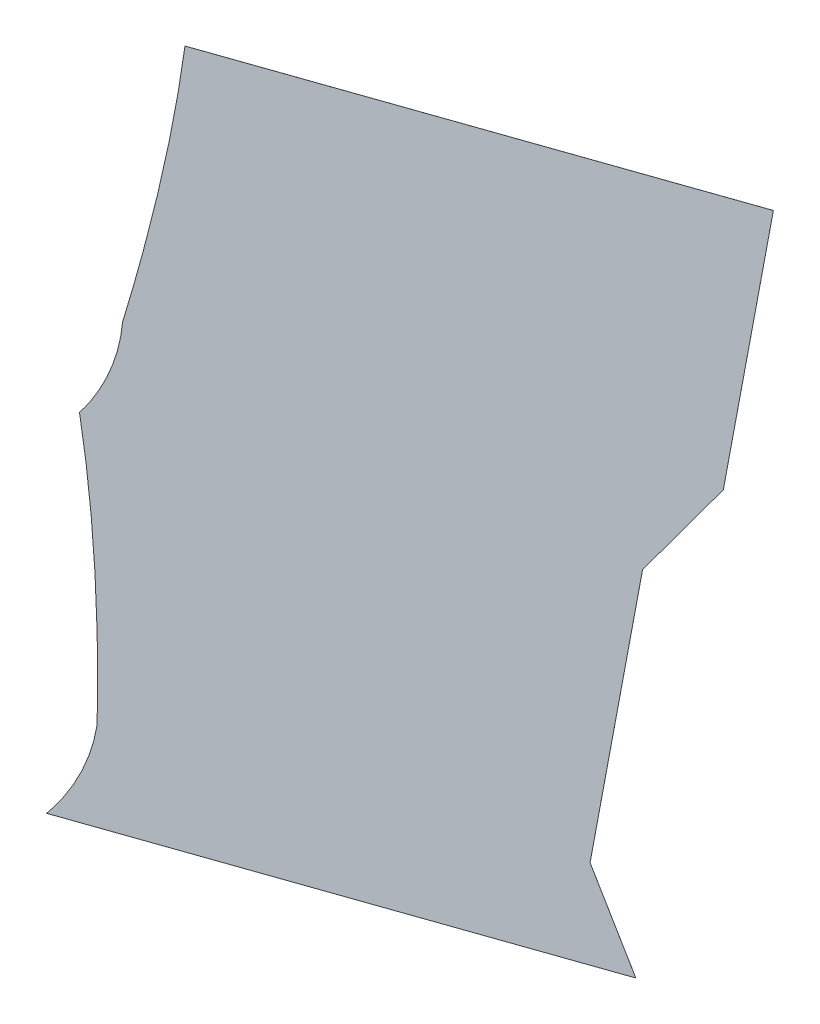
ISO-10303-21;
HEADER;
FILE_DESCRIPTION(('STEP AP214'),'2;1');
FILE_NAME('part.step','',(''),(''),'','','');
FILE_SCHEMA(('AUTOMOTIVE_DESIGN { 1 0 10303 214 1 1 1 1 }'));
ENDSEC;
DATA;
#1=APPLICATION_CONTEXT('core data for automotive mechanical design processes');
#2=APPLICATION_PROTOCOL_DEFINITION('international standard','automotive_design',2000,#1);
#3=PRODUCT_CONTEXT('',#1,'mechanical');
#4=PRODUCT('Part','Part','',(#3));
#5=PRODUCT_RELATED_PRODUCT_CATEGORY('part','',(#4));
#6=PRODUCT_DEFINITION_FORMATION('','',#4);
#7=PRODUCT_DEFINITION_CONTEXT('part definition',#1,'design');
#8=PRODUCT_DEFINITION('design','',#6,#7);
#9=PRODUCT_DEFINITION_SHAPE('','',#8);
#10=(LENGTH_UNIT() NAMED_UNIT(*) SI_UNIT(.MILLI.,.METRE.));
#11=(NAMED_UNIT(*) PLANE_ANGLE_UNIT() SI_UNIT($,.RADIAN.));
#12=(NAMED_UNIT(*) SI_UNIT($,.STERADIAN.) SOLID_ANGLE_UNIT());
#13=UNCERTAINTY_MEASURE_WITH_UNIT(LENGTH_MEASURE(1.E-05),#10,'distance_accuracy_value','');
#14=(GEOMETRIC_REPRESENTATION_CONTEXT(3) GLOBAL_UNCERTAINTY_ASSIGNED_CONTEXT((#13)) GLOBAL_UNIT_ASSIGNED_CONTEXT((#10,
#11,#12)) REPRESENTATION_CONTEXT('',''));
#15=CARTESIAN_POINT('',(0.,0.,0.));
#16=DIRECTION('',(0.,0.,1.));
#17=DIRECTION('',(1.,0.,0.));
#18=AXIS2_PLACEMENT_3D('',#15,#16,#17);
#19=CARTESIAN_POINT('',(151.680220925604,360.398931378131,313.47628043361));
#20=DIRECTION('',(0.887995978439146,-0.103444016227642,-0.448065260629072));
#21=DIRECTION('',(0.,-0.974370064785233,0.224951054343879));
#22=AXIS2_PLACEMENT_3D('',#19,#20,#21);
#23=PLANE('',#22);
#24=DIRECTION('',(0.459851217543135,0.199755631603012,0.865236699040776));
#25=VECTOR('',#24,1.);
#26=CARTESIAN_POINT('',(151.680220925604,360.418418779427,313.471781412523));
#27=LINE('',#26,#25);
#28=CARTESIAN_POINT('',(151.675622413428,360.416421223111,313.463129045533));
#29=VERTEX_POINT('',#28);
#30=CARTESIAN_POINT('',(151.680220925604,360.418418779427,313.471781412523));
#31=VERTEX_POINT('',#30);
#32=EDGE_CURVE('E505',#29,#31,#27,.T.);
#33=ORIENTED_EDGE('',*,*,#32,.F.);
#34=DIRECTION('',(0.,-0.974370064785233,0.224951054343879));
#35=VECTOR('',#34,1.);
#36=CARTESIAN_POINT('',(151.675622413428,360.396933821816,313.46762806662));
#37=LINE('',#36,#35);
#38=CARTESIAN_POINT('',(151.675622413428,434.624445357154,296.330856746703));
#39=VERTEX_POINT('',#38);
#40=EDGE_CURVE('E470',#39,#29,#37,.T.);
#41=ORIENTED_EDGE('',*,*,#40,.F.);
#42=DIRECTION('',(0.459851217543185,0.199755631602159,0.865236699040947));
#43=VECTOR('',#42,1.);
#44=CARTESIAN_POINT('',(151.680220925603,434.626442913471,296.339509113693));
#45=LINE('',#44,#43);
#46=CARTESIAN_POINT('',(151.680220925603,434.626442913471,296.339509113693));
#47=VERTEX_POINT('',#46);
#48=EDGE_CURVE('E514',#39,#47,#45,.T.);
#49=ORIENTED_EDGE('',*,*,#48,.T.);
#50=DIRECTION('',(0.,-0.974370064785233,0.224951054343879));
#51=VECTOR('',#50,1.);
#52=CARTESIAN_POINT('',(151.680220925604,360.398931378131,313.47628043361));
#53=LINE('',#52,#51);
#54=EDGE_CURVE('E476',#47,#31,#53,.T.);
#55=ORIENTED_EDGE('',*,*,#54,.T.);
#56=EDGE_LOOP('',(#33,#41,#49,#55));
#57=FACE_BOUND('',#56,.T.);
#58=ADVANCED_FACE('F231',(#57),#23,.T.);
#59=CARTESIAN_POINT('',(11.6802209255907,368.250898646985,386.069936995522));
#60=DIRECTION('',(-0.459851217543135,-0.199755631603012,-0.865236699040776));
#61=DIRECTION('',(0.123628089728887,-0.979282566119915,0.16038002096141));
#62=AXIS2_PLACEMENT_3D('',#59,#60,#61);
#63=ELLIPSE('',#62,146.750178018493,38.1);
#64=DIRECTION('',(-0.459851217543135,-0.199755631603012,-0.865236699040776));
#65=VECTOR('',#64,1.);
#66=SURFACE_OF_LINEAR_EXTRUSION('',#63,#65);
#67=DIRECTION('',(0.459851217546222,0.199755631601512,0.865236699039481));
#68=VECTOR('',#67,1.);
#69=CARTESIAN_POINT('',(29.5350343621643,448.852790168623,357.960589028568));
#70=LINE('',#69,#68);
#71=CARTESIAN_POINT('',(29.5350343621644,448.852790168623,357.960589028568));
#72=VERTEX_POINT('',#71);
#73=CARTESIAN_POINT('',(29.5396328743397,448.854787724939,357.969241395559));
#74=VERTEX_POINT('',#73);
#75=EDGE_CURVE('E571',#72,#74,#70,.T.);
#76=ORIENTED_EDGE('',*,*,#75,.F.);
#77=CARTESIAN_POINT('',(11.6756224134152,368.248901090669,386.061284628532));
#78=DIRECTION('',(-0.459851217543135,-0.199755631603012,-0.865236699040776));
#79=DIRECTION('',(0.123628089728887,-0.979282566119915,0.16038002096141));
#80=AXIS2_PLACEMENT_3D('',#77,#78,#79);
#81=ELLIPSE('',#80,146.750178018493,38.1);
#82=CARTESIAN_POINT('',(44.7456096076508,372.872862748157,367.417904990697));
#83=VERTEX_POINT('',#82);
#84=EDGE_CURVE('E480',#83,#72,#81,.F.);
#85=ORIENTED_EDGE('',*,*,#84,.F.);
#86=CARTESIAN_POINT('',(44.7456096076507,372.872862748157,367.417904990697));
#87=DIRECTION('',(0.459851217542939,0.199755631601894,0.865236699041138));
#88=VECTOR('',#87,1.);
#89=LINE('',#86,#88);
#90=CARTESIAN_POINT('',(44.7502081198261,372.874860304473,367.426557357687));
#91=VERTEX_POINT('',#90);
#92=EDGE_CURVE('E489',#83,#91,#89,.T.);
#93=ORIENTED_EDGE('',*,*,#92,.T.);
#94=EDGE_CURVE('E479',#91,#74,#63,.F.);
#95=ORIENTED_EDGE('',*,*,#94,.T.);
#96=EDGE_LOOP('',(#76,#85,#93,#95));
#97=FACE_BOUND('',#96,.T.);
#98=ADVANCED_FACE('F496',(#97),#66,.F.);
#99=CARTESIAN_POINT('',(158.540110462806,532.810776324648,270.026013494281));
#100=DIRECTION('',(-0.459851217543135,-0.199755631603012,-0.865236699040776));
#101=DIRECTION('',(-0.88303358136935,0.,0.469309806177135));
#102=AXIS2_PLACEMENT_3D('',#99,#100,#101);
#103=PLANE('',#102);
#104=ORIENTED_EDGE('',*,*,#54,.F.);
#105=DIRECTION('',(0.4073937609096,0.818319076946036,-0.405443228921287));
#106=VECTOR('',#105,1.);
#107=CARTESIAN_POINT('',(151.680220925603,434.62644291347,296.339509113693));
#108=LINE('',#107,#106);
#109=CARTESIAN_POINT('',(151.691023901252,434.648142512015,296.328757860853));
#110=VERTEX_POINT('',#109);
#111=EDGE_CURVE('E561',#47,#110,#108,.T.);
#112=ORIENTED_EDGE('',*,*,#111,.T.);
#113=DIRECTION('',(-0.461479806504052,-0.778701236932887,0.425042082373233));
#114=VECTOR('',#113,1.);
#115=CARTESIAN_POINT('',(153.532901416258,437.756127474735,294.632312115188));
#116=LINE('',#115,#114);
#117=CARTESIAN_POINT('',(165.389197024359,457.762446116088,283.7121710744));
#118=VERTEX_POINT('',#117);
#119=EDGE_CURVE('E586',#118,#110,#116,.T.);
#120=ORIENTED_EDGE('',*,*,#119,.F.);
#121=DIRECTION('',(0.407393760910254,0.818319076943882,-0.405443228924978));
#122=VECTOR('',#121,1.);
#123=CARTESIAN_POINT('',(165.389197024359,457.762446116089,283.712171074399));
#124=LINE('',#123,#122);
#125=CARTESIAN_POINT('',(165.400000000008,457.784145714633,283.701419821559));
#126=VERTEX_POINT('',#125);
#127=EDGE_CURVE('E382',#118,#126,#124,.T.);
#128=ORIENTED_EDGE('',*,*,#127,.T.);
#129=DIRECTION('',(0.,-0.974370064785231,0.224951054343883));
#130=VECTOR('',#129,1.);
#131=CARTESIAN_POINT('',(165.400000000008,532.011657249972,266.564648501642));
#132=LINE('',#131,#130);
#133=CARTESIAN_POINT('',(165.400000000008,528.554592260114,267.362774842454));
#134=VERTEX_POINT('',#133);
#135=EDGE_CURVE('E370',#134,#126,#132,.T.);
#136=ORIENTED_EDGE('',*,*,#135,.F.);
#137=DIRECTION('',(-0.887995978439146,0.103444016227646,0.448065260629072));
#138=VECTOR('',#137,1.);
#139=CARTESIAN_POINT('',(178.529228317984,527.025148275955,260.738025124001));
#140=LINE('',#139,#138);
#141=CARTESIAN_POINT('',(37.7599065995372,543.423582901519,331.76744908065));
#142=VERTEX_POINT('',#141);
#143=EDGE_CURVE('E360',#134,#142,#140,.T.);
#144=ORIENTED_EDGE('',*,*,#143,.T.);
#145=CARTESIAN_POINT('',(-5.4678483962789E-12,468.575510617685,369.115914550579));
#146=DIRECTION('',(-0.459851217543135,-0.199755631603012,-0.865236699040776));
#147=DIRECTION('',(0.123628089728889,0.95047931378405,-0.285140613555117));
#148=AXIS2_PLACEMENT_3D('',#145,#146,#147);
#149=ELLIPSE('',#148,146.750178018493,38.1);
#150=CARTESIAN_POINT('',(35.0929894453342,472.963809633931,349.451767867731));
#151=VERTEX_POINT('',#150);
#152=EDGE_CURVE('E354',#151,#142,#149,.F.);
#153=ORIENTED_EDGE('',*,*,#152,.F.);
#154=DIRECTION('',(0.0162631616268391,0.972312119159769,-0.233119395394161));
#155=VECTOR('',#154,1.);
#156=CARTESIAN_POINT('',(35.1146516202198,474.258908068786,349.141257941793));
#157=LINE('',#156,#155);
#158=CARTESIAN_POINT('',(35.0926061893349,472.94089622623,349.457261535499));
#159=VERTEX_POINT('',#158);
#160=EDGE_CURVE('E387',#151,#159,#157,.F.);
#161=ORIENTED_EDGE('',*,*,#160,.T.);
#162=CARTESIAN_POINT('',(1.08355746927222,474.626220510447,367.143114969039));
#163=DIRECTION('',(-0.459851217543135,-0.199755631603012,-0.865236699040776));
#164=DIRECTION('',(0.408346031858665,-0.912805555850603,-0.00628772403605971));
#165=AXIS2_PLACEMENT_3D('',#162,#163,#164);
#166=ELLIPSE('',#165,39.8408559221603,38.1);
#167=CARTESIAN_POINT('',(29.5457266033037,448.877035910867,357.960866335735));
#168=VERTEX_POINT('',#167);
#169=EDGE_CURVE('E392',#168,#159,#166,.F.);
#170=ORIENTED_EDGE('',*,*,#169,.F.);
#171=DIRECTION('',(0.248308867035991,0.90657491893723,-0.341269135588407));
#172=VECTOR('',#171,1.);
#173=CARTESIAN_POINT('',(34.3183120304122,466.301730801343,351.401551226803));
#174=LINE('',#173,#172);
#175=EDGE_CURVE('E557',#168,#74,#174,.F.);
#176=ORIENTED_EDGE('',*,*,#175,.T.);
#177=ORIENTED_EDGE('',*,*,#94,.F.);
#178=DIRECTION('',(-0.126241724840063,0.979179490256308,-0.158967143683226));
#179=VECTOR('',#178,1.);
#180=CARTESIAN_POINT('',(45.8322516540133,364.482113472291,368.789097121688));
#181=LINE('',#180,#179);
#182=CARTESIAN_POINT('',(44.7532131423753,372.851552190998,367.430341366912));
#183=VERTEX_POINT('',#182);
#184=EDGE_CURVE('E471',#91,#183,#181,.F.);
#185=ORIENTED_EDGE('',*,*,#184,.T.);
#186=CARTESIAN_POINT('',(10.5966634563131,374.554059089428,385.190620879374));
#187=DIRECTION('',(-0.459851217543135,-0.199755631603012,-0.865236699040776));
#188=DIRECTION('',(0.408346031858667,0.817667842230929,-0.405798987242079));
#189=AXIS2_PLACEMENT_3D('',#186,#187,#188);
#190=ELLIPSE('',#189,39.8408559221603,38.1);
#191=CARTESIAN_POINT('',(37.5922025299442,348.95623707825,376.752903875654));
#192=VERTEX_POINT('',#191);
#193=EDGE_CURVE('E428',#192,#183,#190,.F.);
#194=ORIENTED_EDGE('',*,*,#193,.F.);
#195=DIRECTION('',(-0.887995978439146,0.103444016227646,0.448065260629071));
#196=VECTOR('',#195,1.);
#197=CARTESIAN_POINT('',(158.540110462806,334.866829406721,315.72497446348));
#198=LINE('',#197,#196);
#199=CARTESIAN_POINT('',(165.400000000008,334.067710332046,312.263609470842));
#200=VERTEX_POINT('',#199);
#201=EDGE_CURVE('E458',#200,#192,#198,.T.);
#202=ORIENTED_EDGE('',*,*,#201,.F.);
#203=DIRECTION('',(0.46147980650405,-0.88621822068465,-0.0406651388232901));
#204=VECTOR('',#203,1.);
#205=CARTESIAN_POINT('',(153.532901416258,356.857091022939,313.309326324616));
#206=LINE('',#205,#204);
#207=CARTESIAN_POINT('',(151.691023901253,360.394202270411,313.471630728379));
#208=VERTEX_POINT('',#207);
#209=EDGE_CURVE('E437',#208,#200,#206,.T.);
#210=ORIENTED_EDGE('',*,*,#209,.F.);
#211=DIRECTION('',(-0.407393760909242,0.913234927552378,0.00568248806658753));
#212=VECTOR('',#211,1.);
#213=CARTESIAN_POINT('',(151.691023901253,360.394202270411,313.471630728379));
#214=LINE('',#213,#212);
#215=EDGE_CURVE('E466',#208,#31,#214,.T.);
#216=ORIENTED_EDGE('',*,*,#215,.T.);
#217=EDGE_LOOP('',(#104,#112,#120,#128,#136,#144,#153,#161,#170,#176,#177,#185,#194,#202,#210,#216));
#218=FACE_BOUND('',#217,.T.);
#219=ADVANCED_FACE('F233',(#218),#103,.F.);
#220=CARTESIAN_POINT('',(158.535511950631,359.59781474714,310.006263073981));
#221=DIRECTION('',(-0.459851217543135,-0.199755631603012,-0.865236699040776));
#222=DIRECTION('',(0.88303358136935,-0.205731877933245,-0.421812859661817));
#223=AXIS2_PLACEMENT_3D('',#220,#221,#222);
#224=PLANE('',#223);
#225=ORIENTED_EDGE('',*,*,#40,.T.);
#226=DIRECTION('',(-0.407393760909242,0.913234927552378,0.00568248806658753));
#227=VECTOR('',#226,1.);
#228=CARTESIAN_POINT('',(151.686425389077,360.392204714095,313.462978361389));
#229=LINE('',#228,#227);
#230=CARTESIAN_POINT('',(151.686425389077,360.392204714095,313.462978361389));
#231=VERTEX_POINT('',#230);
#232=EDGE_CURVE('E472',#231,#29,#229,.T.);
#233=ORIENTED_EDGE('',*,*,#232,.F.);
#234=DIRECTION('',(0.46147980650405,-0.88621822068465,-0.0406651388232901));
#235=VECTOR('',#234,1.);
#236=CARTESIAN_POINT('',(153.528302904082,356.855093466623,313.300673957626));
#237=LINE('',#236,#235);
#238=CARTESIAN_POINT('',(165.395401487833,334.06571277573,312.254957103851));
#239=VERTEX_POINT('',#238);
#240=EDGE_CURVE('E433',#231,#239,#237,.T.);
#241=ORIENTED_EDGE('',*,*,#240,.T.);
#242=DIRECTION('',(-0.887995978439146,0.103444016227646,0.448065260629071));
#243=VECTOR('',#242,1.);
#244=CARTESIAN_POINT('',(158.53551195063,334.864831850405,315.71632209649));
#245=LINE('',#244,#243);
#246=CARTESIAN_POINT('',(37.5876040177688,348.954239521934,376.744251508664));
#247=VERTEX_POINT('',#246);
#248=EDGE_CURVE('E449',#239,#247,#245,.T.);
#249=ORIENTED_EDGE('',*,*,#248,.T.);
#250=CARTESIAN_POINT('',(10.5920649441376,374.552061533112,385.181968512383));
#251=DIRECTION('',(-0.459851217543135,-0.199755631603012,-0.865236699040776));
#252=DIRECTION('',(0.408346031858667,0.817667842230929,-0.405798987242079));
#253=AXIS2_PLACEMENT_3D('',#250,#251,#252);
#254=ELLIPSE('',#253,39.8408559221603,38.1);
#255=CARTESIAN_POINT('',(44.7486146301999,372.849554634682,367.421688999921));
#256=VERTEX_POINT('',#255);
#257=EDGE_CURVE('E446',#247,#256,#254,.F.);
#258=ORIENTED_EDGE('',*,*,#257,.T.);
#259=DIRECTION('',(-0.126241724840063,0.979179490256308,-0.158967143683226));
#260=VECTOR('',#259,1.);
#261=CARTESIAN_POINT('',(45.8276531418378,364.480115915975,368.780444754698));
#262=LINE('',#261,#260);
#263=EDGE_CURVE('E441',#83,#256,#262,.F.);
#264=ORIENTED_EDGE('',*,*,#263,.F.);
#265=ORIENTED_EDGE('',*,*,#84,.T.);
#266=DIRECTION('',(0.248308867035991,0.90657491893723,-0.341269135588407));
#267=VECTOR('',#266,1.);
#268=CARTESIAN_POINT('',(34.3137135182367,466.299733245027,351.392898859812));
#269=LINE('',#268,#267);
#270=CARTESIAN_POINT('',(29.5411280911282,448.875038354551,357.952213968745));
#271=VERTEX_POINT('',#270);
#272=EDGE_CURVE('E396',#271,#72,#269,.F.);
#273=ORIENTED_EDGE('',*,*,#272,.F.);
#274=CARTESIAN_POINT('',(1.0789589570967,474.624222954131,367.134462602049));
#275=DIRECTION('',(-0.459851217543135,-0.199755631603012,-0.865236699040776));
#276=DIRECTION('',(0.408346031858665,-0.912805555850603,-0.00628772403605971));
#277=AXIS2_PLACEMENT_3D('',#274,#275,#276);
#278=ELLIPSE('',#277,39.8408559221603,38.1);
#279=CARTESIAN_POINT('',(35.0880076771595,472.938898669914,349.448609168509));
#280=VERTEX_POINT('',#279);
#281=EDGE_CURVE('E249',#271,#280,#278,.F.);
#282=ORIENTED_EDGE('',*,*,#281,.T.);
#283=DIRECTION('',(0.0162631616268391,0.972312119159769,-0.233119395394161));
#284=VECTOR('',#283,1.);
#285=CARTESIAN_POINT('',(35.1100531080445,474.25691051247,349.132605574802));
#286=LINE('',#285,#284);
#287=CARTESIAN_POINT('',(35.0883909331589,472.961812077615,349.443115500741));
#288=VERTEX_POINT('',#287);
#289=EDGE_CURVE('E367',#288,#280,#286,.F.);
#290=ORIENTED_EDGE('',*,*,#289,.F.);
#291=CARTESIAN_POINT('',(-0.00459851218084784,468.573513061369,369.107262183589));
#292=DIRECTION('',(-0.459851217543135,-0.199755631603012,-0.865236699040776));
#293=DIRECTION('',(0.123628089728889,0.95047931378405,-0.285140613555117));
#294=AXIS2_PLACEMENT_3D('',#291,#292,#293);
#295=ELLIPSE('',#294,146.750178018493,38.1);
#296=CARTESIAN_POINT('',(37.7553080873619,543.421585345203,331.758796713659));
#297=VERTEX_POINT('',#296);
#298=EDGE_CURVE('E352',#288,#297,#295,.F.);
#299=ORIENTED_EDGE('',*,*,#298,.T.);
#300=DIRECTION('',(-0.887995978439146,0.103444016227646,0.448065260629072));
#301=VECTOR('',#300,1.);
#302=CARTESIAN_POINT('',(178.524629805809,527.023150719639,260.72937275701));
#303=LINE('',#302,#301);
#304=CARTESIAN_POINT('',(165.395401487833,528.552594703798,267.354122475464));
#305=VERTEX_POINT('',#304);
#306=EDGE_CURVE('E361',#305,#297,#303,.T.);
#307=ORIENTED_EDGE('',*,*,#306,.F.);
#308=DIRECTION('',(0.,-0.974370064785231,0.224951054343883));
#309=VECTOR('',#308,1.);
#310=CARTESIAN_POINT('',(165.395401487833,532.009659693656,266.555996134652));
#311=LINE('',#310,#309);
#312=CARTESIAN_POINT('',(165.395401487832,457.782148158317,283.692767454569));
#313=VERTEX_POINT('',#312);
#314=EDGE_CURVE('E369',#305,#313,#311,.T.);
#315=ORIENTED_EDGE('',*,*,#314,.T.);
#316=DIRECTION('',(0.407393760910254,0.818319076943882,-0.405443228924978));
#317=VECTOR('',#316,1.);
#318=CARTESIAN_POINT('',(165.384598512183,457.760448559773,283.703518707409));
#319=LINE('',#318,#317);
#320=CARTESIAN_POINT('',(165.384598512183,457.760448559772,283.703518707409));
#321=VERTEX_POINT('',#320);
#322=EDGE_CURVE('E388',#321,#313,#319,.T.);
#323=ORIENTED_EDGE('',*,*,#322,.F.);
#324=DIRECTION('',(-0.461479806504052,-0.778701236932887,0.425042082373233));
#325=VECTOR('',#324,1.);
#326=CARTESIAN_POINT('',(153.528302904082,437.754129918419,294.623659748197));
#327=LINE('',#326,#325);
#328=CARTESIAN_POINT('',(151.686425389077,434.646144955699,296.320105493863));
#329=VERTEX_POINT('',#328);
#330=EDGE_CURVE('E257',#321,#329,#327,.T.);
#331=ORIENTED_EDGE('',*,*,#330,.T.);
#332=DIRECTION('',(0.4073937609096,0.818319076946036,-0.405443228921287));
#333=VECTOR('',#332,1.);
#334=CARTESIAN_POINT('',(151.675622413428,434.624445357155,296.330856746703));
#335=LINE('',#334,#333);
#336=EDGE_CURVE('E435',#39,#329,#335,.T.);
#337=ORIENTED_EDGE('',*,*,#336,.F.);
#338=EDGE_LOOP('',(#225,#233,#241,#249,#258,#264,#265,#273,#282,#290,#299,#307,#315,#323,#331,#337));
#339=FACE_BOUND('',#338,.T.);
#340=ADVANCED_FACE('F364',(#339),#224,.T.);
#341=CARTESIAN_POINT('',(44.7502081198261,372.874860304473,367.426557357687));
#342=DIRECTION('',(0.878976612109746,0.0361277387103429,-0.475494376265115));
#343=DIRECTION('',(0.475988746001993,-0.00605354861869076,0.879430536329375));
#344=AXIS2_PLACEMENT_3D('',#341,#342,#343);
#345=PLANE('',#344);
#346=ORIENTED_EDGE('',*,*,#92,.F.);
#347=ORIENTED_EDGE('',*,*,#263,.T.);
#348=DIRECTION('',(0.459851217539109,0.19975563160234,0.86523669904307));
#349=VECTOR('',#348,1.);
#350=CARTESIAN_POINT('',(44.7486146301998,372.849554634682,367.421688999921));
#351=LINE('',#350,#349);
#352=EDGE_CURVE('E465',#256,#183,#351,.T.);
#353=ORIENTED_EDGE('',*,*,#352,.T.);
#354=ORIENTED_EDGE('',*,*,#184,.F.);
#355=EDGE_LOOP('',(#346,#347,#353,#354));
#356=FACE_BOUND('',#355,.T.);
#357=ADVANCED_FACE('F529',(#356),#345,.F.);
#358=CARTESIAN_POINT('',(151.688724645165,360.393203492253,313.467304544884));
#359=DIRECTION('',(0.789029265171344,0.355105131955014,-0.501331391359429));
#360=DIRECTION('',(-0.407393760909242,0.913234927552378,0.00568248806658753));
#361=AXIS2_PLACEMENT_3D('',#358,#359,#360);
#362=PLANE('',#361);
#363=ORIENTED_EDGE('',*,*,#232,.T.);
#364=ORIENTED_EDGE('',*,*,#32,.T.);
#365=ORIENTED_EDGE('',*,*,#215,.F.);
#366=DIRECTION('',(0.459851217543116,0.199755631603068,0.865236699040774));
#367=VECTOR('',#366,1.);
#368=CARTESIAN_POINT('',(151.691023901253,360.394202270411,313.471630728379));
#369=LINE('',#368,#367);
#370=EDGE_CURVE('E442',#231,#208,#369,.T.);
#371=ORIENTED_EDGE('',*,*,#370,.F.);
#372=EDGE_LOOP('',(#363,#364,#365,#371));
#373=FACE_BOUND('',#372,.T.);
#374=ADVANCED_FACE('F421',(#373),#362,.T.);
#375=CARTESIAN_POINT('',(158.540110462806,334.866829406721,315.72497446348));
#376=DIRECTION('',(0.,-0.974370064785232,0.224951054343881));
#377=DIRECTION('',(-0.887995978439146,0.103444016227646,0.448065260629071));
#378=AXIS2_PLACEMENT_3D('',#375,#376,#377);
#379=PLANE('',#378);
#380=DIRECTION('',(0.459851217543135,0.199755631603012,0.865236699040776));
#381=VECTOR('',#380,1.);
#382=CARTESIAN_POINT('',(37.5922025299442,348.95623707825,376.752903875654));
#383=LINE('',#382,#381);
#384=EDGE_CURVE('E434',#247,#192,#383,.T.);
#385=ORIENTED_EDGE('',*,*,#384,.F.);
#386=ORIENTED_EDGE('',*,*,#248,.F.);
#387=DIRECTION('',(0.459851217543135,0.199755631603012,0.865236699040776));
#388=VECTOR('',#387,1.);
#389=CARTESIAN_POINT('',(165.400000000008,334.067710332046,312.263609470842));
#390=LINE('',#389,#388);
#391=EDGE_CURVE('E462',#239,#200,#390,.T.);
#392=ORIENTED_EDGE('',*,*,#391,.T.);
#393=ORIENTED_EDGE('',*,*,#201,.T.);
#394=EDGE_LOOP('',(#385,#386,#392,#393));
#395=FACE_BOUND('',#394,.T.);
#396=ADVANCED_FACE('F417',(#395),#379,.T.);
#397=DIRECTION('',(-0.459851217543135,-0.199755631603012,-0.865236699040776));
#398=VECTOR('',#397,1.);
#399=SURFACE_OF_LINEAR_EXTRUSION('',#190,#398);
#400=ORIENTED_EDGE('',*,*,#352,.F.);
#401=ORIENTED_EDGE('',*,*,#257,.F.);
#402=ORIENTED_EDGE('',*,*,#384,.T.);
#403=ORIENTED_EDGE('',*,*,#193,.T.);
#404=EDGE_LOOP('',(#400,#401,#402,#403));
#405=FACE_BOUND('',#404,.T.);
#406=ADVANCED_FACE('F420',(#405),#399,.F.);
#407=CARTESIAN_POINT('',(153.532901416258,356.857091022939,313.309326324616));
#408=DIRECTION('',(0.758665437405106,0.417989178052992,-0.499711718010999));
#409=DIRECTION('',(0.46147980650405,-0.88621822068465,-0.0406651388232901));
#410=AXIS2_PLACEMENT_3D('',#407,#408,#409);
#411=PLANE('',#410);
#412=ORIENTED_EDGE('',*,*,#391,.F.);
#413=ORIENTED_EDGE('',*,*,#240,.F.);
#414=ORIENTED_EDGE('',*,*,#370,.T.);
#415=ORIENTED_EDGE('',*,*,#209,.T.);
#416=EDGE_LOOP('',(#412,#413,#414,#415));
#417=FACE_BOUND('',#416,.T.);
#418=ADVANCED_FACE('F415',(#417),#411,.T.);
#419=CARTESIAN_POINT('',(29.5457266033037,448.877035910867,357.960866335735));
#420=DIRECTION('',(0.852572322018706,-0.37177897196777,-0.367288485703296));
#421=DIRECTION('',(-0.320721520792088,-0.927101855012043,0.193958388666332));
#422=AXIS2_PLACEMENT_3D('',#419,#420,#421);
#423=PLANE('',#422);
#424=DIRECTION('',(-0.459851217546496,-0.19975563160148,-0.865236699039343));
#425=VECTOR('',#424,1.);
#426=CARTESIAN_POINT('',(29.5457266033037,448.877035910867,357.960866335735));
#427=LINE('',#426,#425);
#428=EDGE_CURVE('E397',#271,#168,#427,.F.);
#429=ORIENTED_EDGE('',*,*,#428,.F.);
#430=ORIENTED_EDGE('',*,*,#272,.T.);
#431=ORIENTED_EDGE('',*,*,#75,.T.);
#432=ORIENTED_EDGE('',*,*,#175,.F.);
#433=EDGE_LOOP('',(#429,#430,#431,#432));
#434=FACE_BOUND('',#433,.T.);
#435=ADVANCED_FACE('F411',(#434),#423,.F.);
#436=CARTESIAN_POINT('',(151.677921669516,434.625444135312,296.335182930198));
#437=DIRECTION('',(0.789029265171219,-0.538935595363303,-0.294925825850785));
#438=DIRECTION('',(0.4073937609096,0.818319076946036,-0.405443228921287));
#439=AXIS2_PLACEMENT_3D('',#436,#437,#438);
#440=PLANE('',#439);
#441=ORIENTED_EDGE('',*,*,#336,.T.);
#442=DIRECTION('',(0.459851217543135,0.199755631603012,0.865236699040776));
#443=VECTOR('',#442,1.);
#444=CARTESIAN_POINT('',(151.691023901253,434.648142512015,296.328757860853));
#445=LINE('',#444,#443);
#446=EDGE_CURVE('E386',#329,#110,#445,.T.);
#447=ORIENTED_EDGE('',*,*,#446,.T.);
#448=ORIENTED_EDGE('',*,*,#111,.F.);
#449=ORIENTED_EDGE('',*,*,#48,.F.);
#450=EDGE_LOOP('',(#441,#447,#448,#449));
#451=FACE_BOUND('',#450,.T.);
#452=ADVANCED_FACE('F408',(#451),#440,.T.);
#453=CARTESIAN_POINT('',(153.532901416258,437.756127474735,294.632312115188));
#454=DIRECTION('',(0.758665437405105,-0.594745383539943,-0.265903521685681));
#455=DIRECTION('',(-0.461479806504052,-0.778701236932887,0.425042082373233));
#456=AXIS2_PLACEMENT_3D('',#453,#454,#455);
#457=PLANE('',#456);
#458=ORIENTED_EDGE('',*,*,#446,.F.);
#459=ORIENTED_EDGE('',*,*,#330,.F.);
#460=DIRECTION('',(0.459851217543153,0.199755631601779,0.865236699041052));
#461=VECTOR('',#460,1.);
#462=CARTESIAN_POINT('',(165.389197024359,457.762446116088,283.7121710744));
#463=LINE('',#462,#461);
#464=EDGE_CURVE('E241',#321,#118,#463,.T.);
#465=ORIENTED_EDGE('',*,*,#464,.T.);
#466=ORIENTED_EDGE('',*,*,#119,.T.);
#467=EDGE_LOOP('',(#458,#459,#465,#466));
#468=FACE_BOUND('',#467,.T.);
#469=ADVANCED_FACE('F405',(#468),#457,.T.);
#470=DIRECTION('',(-0.459851217543135,-0.199755631603012,-0.865236699040776));
#471=VECTOR('',#470,1.);
#472=SURFACE_OF_LINEAR_EXTRUSION('',#166,#471);
#473=DIRECTION('',(0.459851217536353,0.199755631601445,0.865236699044742));
#474=VECTOR('',#473,1.);
#475=CARTESIAN_POINT('',(35.0880076771595,472.938898669914,349.448609168509));
#476=LINE('',#475,#474);
#477=EDGE_CURVE('E13',#280,#159,#476,.T.);
#478=ORIENTED_EDGE('',*,*,#477,.F.);
#479=ORIENTED_EDGE('',*,*,#281,.F.);
#480=ORIENTED_EDGE('',*,*,#428,.T.);
#481=ORIENTED_EDGE('',*,*,#169,.T.);
#482=EDGE_LOOP('',(#478,#479,#480,#481));
#483=FACE_BOUND('',#482,.T.);
#484=ADVANCED_FACE('F400',(#483),#472,.F.);
#485=CARTESIAN_POINT('',(35.0929894453341,472.963809633931,349.451767867731));
#486=DIRECTION('',(0.88784704048822,-0.121271722085504,-0.443870253698899));
#487=DIRECTION('',(-0.447170664896602,0.,-0.894448655013764));
#488=AXIS2_PLACEMENT_3D('',#485,#486,#487);
#489=PLANE('',#488);
#490=DIRECTION('',(-0.459851217536941,-0.19975563160381,-0.865236699043884));
#491=VECTOR('',#490,1.);
#492=CARTESIAN_POINT('',(35.0929894453341,472.96380963393,349.451767867731));
#493=LINE('',#492,#491);
#494=EDGE_CURVE('E235',#288,#151,#493,.F.);
#495=ORIENTED_EDGE('',*,*,#494,.F.);
#496=ORIENTED_EDGE('',*,*,#289,.T.);
#497=ORIENTED_EDGE('',*,*,#477,.T.);
#498=ORIENTED_EDGE('',*,*,#160,.F.);
#499=EDGE_LOOP('',(#495,#496,#497,#498));
#500=FACE_BOUND('',#499,.T.);
#501=ADVANCED_FACE('F404',(#500),#489,.F.);
#502=CARTESIAN_POINT('',(165.386897768271,457.761447337931,283.707844890904));
#503=DIRECTION('',(0.789029265170092,-0.538935595365567,-0.294925825849664));
#504=DIRECTION('',(0.407393760910254,0.818319076943882,-0.405443228924978));
#505=AXIS2_PLACEMENT_3D('',#502,#503,#504);
#506=PLANE('',#505);
#507=ORIENTED_EDGE('',*,*,#322,.T.);
#508=DIRECTION('',(0.459851217543135,0.199755631603012,0.865236699040776));
#509=VECTOR('',#508,1.);
#510=CARTESIAN_POINT('',(165.400000000008,457.784145714633,283.701419821559));
#511=LINE('',#510,#509);
#512=EDGE_CURVE('E375',#313,#126,#511,.T.);
#513=ORIENTED_EDGE('',*,*,#512,.T.);
#514=ORIENTED_EDGE('',*,*,#127,.F.);
#515=ORIENTED_EDGE('',*,*,#464,.F.);
#516=EDGE_LOOP('',(#507,#513,#514,#515));
#517=FACE_BOUND('',#516,.T.);
#518=ADVANCED_FACE('F597',(#517),#506,.T.);
#519=CARTESIAN_POINT('',(178.529228317984,527.025148275955,260.738025124001));
#520=DIRECTION('',(0.,-0.974370064785232,0.224951054343881));
#521=DIRECTION('',(-0.887995978439146,0.103444016227646,0.448065260629072));
#522=AXIS2_PLACEMENT_3D('',#519,#520,#521);
#523=PLANE('',#522);
#524=DIRECTION('',(0.459851217543135,0.199755631603012,0.865236699040776));
#525=VECTOR('',#524,1.);
#526=CARTESIAN_POINT('',(165.400000000008,528.554592260114,267.362774842454));
#527=LINE('',#526,#525);
#528=EDGE_CURVE('E373',#305,#134,#527,.T.);
#529=ORIENTED_EDGE('',*,*,#528,.F.);
#530=ORIENTED_EDGE('',*,*,#306,.T.);
#531=DIRECTION('',(0.459851217543135,0.199755631603012,0.865236699040776));
#532=VECTOR('',#531,1.);
#533=CARTESIAN_POINT('',(37.7599065995372,543.423582901519,331.76744908065));
#534=LINE('',#533,#532);
#535=EDGE_CURVE('E348',#297,#142,#534,.T.);
#536=ORIENTED_EDGE('',*,*,#535,.T.);
#537=ORIENTED_EDGE('',*,*,#143,.F.);
#538=EDGE_LOOP('',(#529,#530,#536,#537));
#539=FACE_BOUND('',#538,.T.);
#540=ADVANCED_FACE('F372',(#539),#523,.F.);
#541=CARTESIAN_POINT('',(165.400000000008,532.011657249972,266.564648501642));
#542=DIRECTION('',(0.887995978439146,-0.10344401622765,-0.448065260629071));
#543=DIRECTION('',(0.,-0.974370064785231,0.224951054343883));
#544=AXIS2_PLACEMENT_3D('',#541,#542,#543);
#545=PLANE('',#544);
#546=ORIENTED_EDGE('',*,*,#512,.F.);
#547=ORIENTED_EDGE('',*,*,#314,.F.);
#548=ORIENTED_EDGE('',*,*,#528,.T.);
#549=ORIENTED_EDGE('',*,*,#135,.T.);
#550=EDGE_LOOP('',(#546,#547,#548,#549));
#551=FACE_BOUND('',#550,.T.);
#552=ADVANCED_FACE('F615',(#551),#545,.T.);
#553=DIRECTION('',(-0.459851217543135,-0.199755631603012,-0.865236699040776));
#554=VECTOR('',#553,1.);
#555=SURFACE_OF_LINEAR_EXTRUSION('',#149,#554);
#556=ORIENTED_EDGE('',*,*,#535,.F.);
#557=ORIENTED_EDGE('',*,*,#298,.F.);
#558=ORIENTED_EDGE('',*,*,#494,.T.);
#559=ORIENTED_EDGE('',*,*,#152,.T.);
#560=EDGE_LOOP('',(#556,#557,#558,#559));
#561=FACE_BOUND('',#560,.T.);
#562=ADVANCED_FACE('F350',(#561),#555,.F.);
#563=CLOSED_SHELL('',(#58,#98,#219,#340,#357,#374,#396,#406,#418,#435,#452,#469,#484,#501,#518,
#540,#552,#562));
#564=MANIFOLD_SOLID_BREP('B2',#563);
#565=ADVANCED_BREP_SHAPE_REPRESENTATION('',(#18,#564),#14);
#566=SHAPE_DEFINITION_REPRESENTATION(#9,#565);
ENDSEC;
END-ISO-10303-21;
